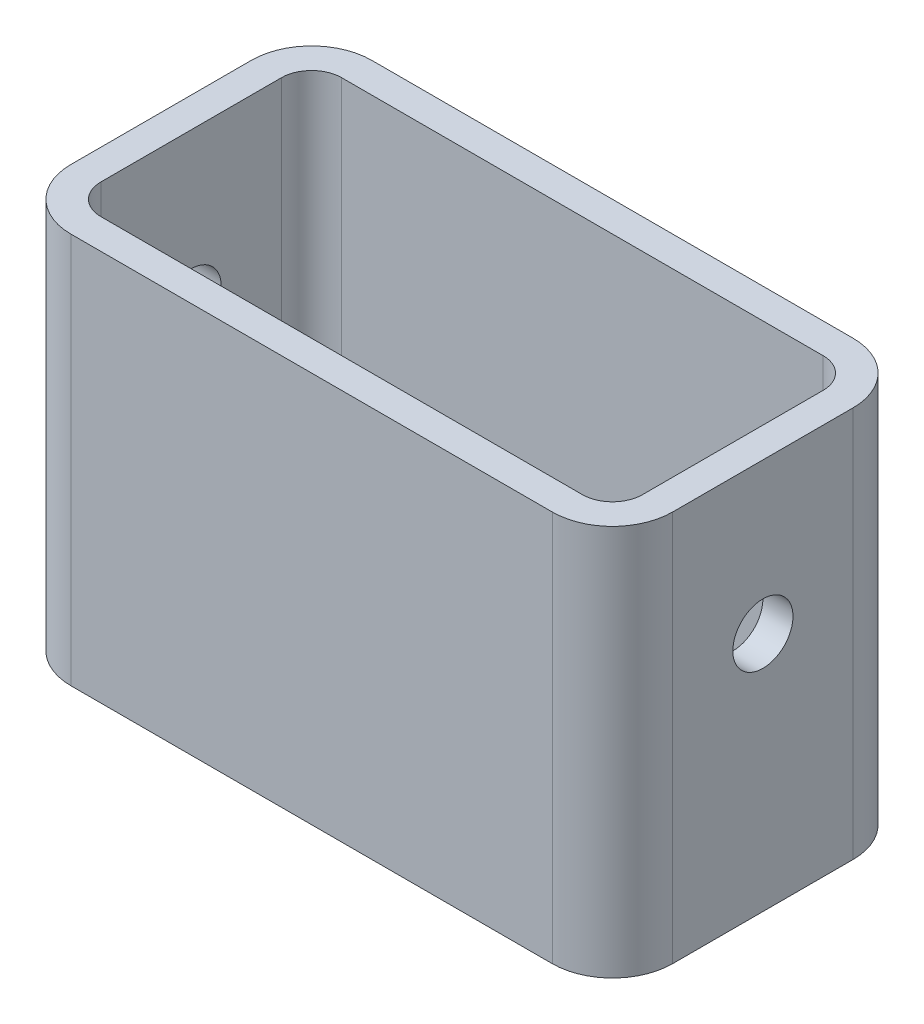
ISO-10303-21;
HEADER;
FILE_DESCRIPTION(('STEP AP214'),'2;1');
FILE_NAME('part.step','',(''),(''),'','','');
FILE_SCHEMA(('AUTOMOTIVE_DESIGN { 1 0 10303 214 1 1 1 1 }'));
ENDSEC;
DATA;
#1=APPLICATION_CONTEXT('core data for automotive mechanical design processes');
#2=APPLICATION_PROTOCOL_DEFINITION('international standard','automotive_design',2000,#1);
#3=PRODUCT_CONTEXT('',#1,'mechanical');
#4=PRODUCT('Part','Part','',(#3));
#5=PRODUCT_RELATED_PRODUCT_CATEGORY('part','',(#4));
#6=PRODUCT_DEFINITION_FORMATION('','',#4);
#7=PRODUCT_DEFINITION_CONTEXT('part definition',#1,'design');
#8=PRODUCT_DEFINITION('design','',#6,#7);
#9=PRODUCT_DEFINITION_SHAPE('','',#8);
#10=(LENGTH_UNIT() NAMED_UNIT(*) SI_UNIT(.MILLI.,.METRE.));
#11=(NAMED_UNIT(*) PLANE_ANGLE_UNIT() SI_UNIT($,.RADIAN.));
#12=(NAMED_UNIT(*) SI_UNIT($,.STERADIAN.) SOLID_ANGLE_UNIT());
#13=UNCERTAINTY_MEASURE_WITH_UNIT(LENGTH_MEASURE(1.E-05),#10,'distance_accuracy_value','');
#14=(GEOMETRIC_REPRESENTATION_CONTEXT(3) GLOBAL_UNCERTAINTY_ASSIGNED_CONTEXT((#13)) GLOBAL_UNIT_ASSIGNED_CONTEXT((#10,
#11,#12)) REPRESENTATION_CONTEXT('',''));
#15=CARTESIAN_POINT('',(0.,0.,0.));
#16=DIRECTION('',(0.,0.,1.));
#17=DIRECTION('',(1.,0.,0.));
#18=AXIS2_PLACEMENT_3D('',#15,#16,#17);
#19=CARTESIAN_POINT('',(0.,0.,50.));
#20=DIRECTION('',(1.,0.,0.));
#21=DIRECTION('',(0.,1.,0.));
#22=AXIS2_PLACEMENT_3D('',#19,#20,#21);
#23=PLANE('',#22);
#24=CARTESIAN_POINT('',(0.,40.,25.));
#25=DIRECTION('',(1.,0.,0.));
#26=DIRECTION('',(0.,1.,0.));
#27=AXIS2_PLACEMENT_3D('',#24,#25,#26);
#28=CIRCLE('',#27,5.);
#29=CARTESIAN_POINT('',(0.,45.,25.));
#30=VERTEX_POINT('',#29);
#31=EDGE_CURVE('E365',#30,#30,#28,.T.);
#32=ORIENTED_EDGE('',*,*,#31,.T.);
#33=EDGE_LOOP('',(#32));
#34=FACE_BOUND('',#33,.T.);
#35=DIRECTION('',(0.,0.,-1.));
#36=VECTOR('',#35,1.);
#37=CARTESIAN_POINT('',(0.,65.,50.));
#38=LINE('',#37,#36);
#39=CARTESIAN_POINT('',(0.,65.,40.));
#40=VERTEX_POINT('',#39);
#41=CARTESIAN_POINT('',(0.,65.,10.));
#42=VERTEX_POINT('',#41);
#43=EDGE_CURVE('E214',#40,#42,#38,.T.);
#44=ORIENTED_EDGE('',*,*,#43,.T.);
#45=DIRECTION('',(0.,-1.,0.));
#46=VECTOR('',#45,1.);
#47=CARTESIAN_POINT('',(0.,0.,10.));
#48=LINE('',#47,#46);
#49=CARTESIAN_POINT('',(0.,0.,10.));
#50=VERTEX_POINT('',#49);
#51=EDGE_CURVE('E232',#42,#50,#48,.T.);
#52=ORIENTED_EDGE('',*,*,#51,.T.);
#53=DIRECTION('',(0.,0.,-1.));
#54=VECTOR('',#53,1.);
#55=CARTESIAN_POINT('',(0.,0.,50.));
#56=LINE('',#55,#54);
#57=CARTESIAN_POINT('',(0.,0.,40.));
#58=VERTEX_POINT('',#57);
#59=EDGE_CURVE('E227',#58,#50,#56,.T.);
#60=ORIENTED_EDGE('',*,*,#59,.F.);
#61=DIRECTION('',(0.,-1.,0.));
#62=VECTOR('',#61,1.);
#63=CARTESIAN_POINT('',(0.,0.,40.));
#64=LINE('',#63,#62);
#65=EDGE_CURVE('E230',#58,#40,#64,.F.);
#66=ORIENTED_EDGE('',*,*,#65,.T.);
#67=EDGE_LOOP('',(#44,#52,#60,#66));
#68=FACE_BOUND('',#67,.T.);
#69=ADVANCED_FACE('F34',(#34,#68),#23,.F.);
#70=CARTESIAN_POINT('',(0.,0.,50.));
#71=DIRECTION('',(0.,1.,0.));
#72=DIRECTION('',(0.,0.,1.));
#73=AXIS2_PLACEMENT_3D('',#70,#71,#72);
#74=PLANE('',#73);
#75=ORIENTED_EDGE('',*,*,#59,.T.);
#76=CARTESIAN_POINT('',(10.,0.,10.));
#77=DIRECTION('',(0.,1.,0.));
#78=DIRECTION('',(0.,0.,1.));
#79=AXIS2_PLACEMENT_3D('',#76,#77,#78);
#80=CIRCLE('',#79,10.);
#81=CARTESIAN_POINT('',(10.,0.,0.));
#82=VERTEX_POINT('',#81);
#83=EDGE_CURVE('E241',#50,#82,#80,.F.);
#84=ORIENTED_EDGE('',*,*,#83,.T.);
#85=DIRECTION('',(1.,0.,0.));
#86=VECTOR('',#85,1.);
#87=CARTESIAN_POINT('',(0.,0.,0.));
#88=LINE('',#87,#86);
#89=CARTESIAN_POINT('',(90.,0.,0.));
#90=VERTEX_POINT('',#89);
#91=EDGE_CURVE('E190',#82,#90,#88,.T.);
#92=ORIENTED_EDGE('',*,*,#91,.T.);
#93=CARTESIAN_POINT('',(90.,0.,10.));
#94=DIRECTION('',(0.,1.,0.));
#95=DIRECTION('',(0.,0.,1.));
#96=AXIS2_PLACEMENT_3D('',#93,#94,#95);
#97=CIRCLE('',#96,10.);
#98=CARTESIAN_POINT('',(100.,0.,10.));
#99=VERTEX_POINT('',#98);
#100=EDGE_CURVE('E239',#90,#99,#97,.F.);
#101=ORIENTED_EDGE('',*,*,#100,.T.);
#102=DIRECTION('',(0.,0.,-1.));
#103=VECTOR('',#102,1.);
#104=CARTESIAN_POINT('',(100.,0.,50.));
#105=LINE('',#104,#103);
#106=CARTESIAN_POINT('',(100.,0.,40.));
#107=VERTEX_POINT('',#106);
#108=EDGE_CURVE('E224',#107,#99,#105,.T.);
#109=ORIENTED_EDGE('',*,*,#108,.F.);
#110=CARTESIAN_POINT('',(90.,0.,40.));
#111=DIRECTION('',(0.,1.,0.));
#112=DIRECTION('',(0.,0.,1.));
#113=AXIS2_PLACEMENT_3D('',#110,#111,#112);
#114=CIRCLE('',#113,10.);
#115=CARTESIAN_POINT('',(90.,0.,50.));
#116=VERTEX_POINT('',#115);
#117=EDGE_CURVE('E235',#107,#116,#114,.F.);
#118=ORIENTED_EDGE('',*,*,#117,.T.);
#119=DIRECTION('',(1.,0.,0.));
#120=VECTOR('',#119,1.);
#121=CARTESIAN_POINT('',(0.,0.,50.));
#122=LINE('',#121,#120);
#123=CARTESIAN_POINT('',(10.,0.,50.));
#124=VERTEX_POINT('',#123);
#125=EDGE_CURVE('E207',#124,#116,#122,.T.);
#126=ORIENTED_EDGE('',*,*,#125,.F.);
#127=CARTESIAN_POINT('',(10.,0.,40.));
#128=DIRECTION('',(0.,1.,0.));
#129=DIRECTION('',(0.,0.,1.));
#130=AXIS2_PLACEMENT_3D('',#127,#128,#129);
#131=CIRCLE('',#130,10.);
#132=EDGE_CURVE('E237',#124,#58,#131,.F.);
#133=ORIENTED_EDGE('',*,*,#132,.T.);
#134=EDGE_LOOP('',(#75,#84,#92,#101,#109,#118,#126,#133));
#135=FACE_BOUND('',#134,.T.);
#136=ADVANCED_FACE('F276',(#135),#74,.F.);
#137=CARTESIAN_POINT('',(100.,0.,50.));
#138=DIRECTION('',(-1.,0.,0.));
#139=DIRECTION('',(0.,-1.,0.));
#140=AXIS2_PLACEMENT_3D('',#137,#138,#139);
#141=PLANE('',#140);
#142=CARTESIAN_POINT('',(100.,40.,25.));
#143=DIRECTION('',(1.,0.,0.));
#144=DIRECTION('',(0.,1.,0.));
#145=AXIS2_PLACEMENT_3D('',#142,#143,#144);
#146=CIRCLE('',#145,5.);
#147=CARTESIAN_POINT('',(100.,45.,25.));
#148=VERTEX_POINT('',#147);
#149=EDGE_CURVE('E363',#148,#148,#146,.T.);
#150=ORIENTED_EDGE('',*,*,#149,.F.);
#151=EDGE_LOOP('',(#150));
#152=FACE_BOUND('',#151,.T.);
#153=ORIENTED_EDGE('',*,*,#108,.T.);
#154=DIRECTION('',(0.,1.,0.));
#155=VECTOR('',#154,1.);
#156=CARTESIAN_POINT('',(100.,65.,10.));
#157=LINE('',#156,#155);
#158=CARTESIAN_POINT('',(100.,65.,10.));
#159=VERTEX_POINT('',#158);
#160=EDGE_CURVE('E256',#99,#159,#157,.T.);
#161=ORIENTED_EDGE('',*,*,#160,.T.);
#162=DIRECTION('',(0.,0.,-1.));
#163=VECTOR('',#162,1.);
#164=CARTESIAN_POINT('',(100.,65.,50.));
#165=LINE('',#164,#163);
#166=CARTESIAN_POINT('',(100.,65.,40.));
#167=VERTEX_POINT('',#166);
#168=EDGE_CURVE('E221',#167,#159,#165,.T.);
#169=ORIENTED_EDGE('',*,*,#168,.F.);
#170=DIRECTION('',(0.,1.,0.));
#171=VECTOR('',#170,1.);
#172=CARTESIAN_POINT('',(100.,0.,40.));
#173=LINE('',#172,#171);
#174=EDGE_CURVE('E254',#167,#107,#173,.F.);
#175=ORIENTED_EDGE('',*,*,#174,.T.);
#176=EDGE_LOOP('',(#153,#161,#169,#175));
#177=FACE_BOUND('',#176,.T.);
#178=ADVANCED_FACE('F281',(#152,#177),#141,.F.);
#179=CARTESIAN_POINT('',(0.,65.,50.));
#180=DIRECTION('',(0.,-1.,0.));
#181=DIRECTION('',(0.,0.,-1.));
#182=AXIS2_PLACEMENT_3D('',#179,#180,#181);
#183=PLANE('',#182);
#184=DIRECTION('',(-1.,0.,0.));
#185=VECTOR('',#184,1.);
#186=CARTESIAN_POINT('',(0.,65.,5.));
#187=LINE('',#186,#185);
#188=CARTESIAN_POINT('',(90.,65.,5.));
#189=VERTEX_POINT('',#188);
#190=CARTESIAN_POINT('',(9.99999999999997,65.,5.));
#191=VERTEX_POINT('',#190);
#192=EDGE_CURVE('E171',#189,#191,#187,.T.);
#193=ORIENTED_EDGE('',*,*,#192,.F.);
#194=CARTESIAN_POINT('',(90.,65.,10.));
#195=DIRECTION('',(0.,-1.,0.));
#196=DIRECTION('',(0.,0.,-1.));
#197=AXIS2_PLACEMENT_3D('',#194,#195,#196);
#198=CIRCLE('',#197,5.);
#199=CARTESIAN_POINT('',(95.,65.,10.));
#200=VERTEX_POINT('',#199);
#201=EDGE_CURVE('E196',#200,#189,#198,.F.);
#202=ORIENTED_EDGE('',*,*,#201,.F.);
#203=DIRECTION('',(0.,0.,-1.));
#204=VECTOR('',#203,1.);
#205=CARTESIAN_POINT('',(95.,65.,50.));
#206=LINE('',#205,#204);
#207=CARTESIAN_POINT('',(95.,65.,40.));
#208=VERTEX_POINT('',#207);
#209=EDGE_CURVE('E50',#208,#200,#206,.T.);
#210=ORIENTED_EDGE('',*,*,#209,.F.);
#211=CARTESIAN_POINT('',(90.,65.,40.));
#212=DIRECTION('',(0.,-1.,0.));
#213=DIRECTION('',(0.,0.,-1.));
#214=AXIS2_PLACEMENT_3D('',#211,#212,#213);
#215=CIRCLE('',#214,5.);
#216=CARTESIAN_POINT('',(90.,65.,45.));
#217=VERTEX_POINT('',#216);
#218=EDGE_CURVE('E177',#217,#208,#215,.F.);
#219=ORIENTED_EDGE('',*,*,#218,.F.);
#220=DIRECTION('',(-1.,0.,0.));
#221=VECTOR('',#220,1.);
#222=CARTESIAN_POINT('',(0.,65.,45.));
#223=LINE('',#222,#221);
#224=CARTESIAN_POINT('',(9.99999999999997,65.,45.));
#225=VERTEX_POINT('',#224);
#226=EDGE_CURVE('E194',#217,#225,#223,.T.);
#227=ORIENTED_EDGE('',*,*,#226,.T.);
#228=CARTESIAN_POINT('',(9.99999999999997,65.,40.));
#229=DIRECTION('',(0.,-1.,0.));
#230=DIRECTION('',(0.,0.,-1.));
#231=AXIS2_PLACEMENT_3D('',#228,#229,#230);
#232=CIRCLE('',#231,5.);
#233=CARTESIAN_POINT('',(4.99999999999997,65.,40.));
#234=VERTEX_POINT('',#233);
#235=EDGE_CURVE('E179',#234,#225,#232,.F.);
#236=ORIENTED_EDGE('',*,*,#235,.F.);
#237=DIRECTION('',(0.,0.,-1.));
#238=VECTOR('',#237,1.);
#239=CARTESIAN_POINT('',(4.99999999999997,65.,50.));
#240=LINE('',#239,#238);
#241=CARTESIAN_POINT('',(4.99999999999997,65.,10.));
#242=VERTEX_POINT('',#241);
#243=EDGE_CURVE('E191',#234,#242,#240,.T.);
#244=ORIENTED_EDGE('',*,*,#243,.T.);
#245=CARTESIAN_POINT('',(9.99999999999997,65.,10.));
#246=DIRECTION('',(0.,-1.,0.));
#247=DIRECTION('',(0.,0.,-1.));
#248=AXIS2_PLACEMENT_3D('',#245,#246,#247);
#249=CIRCLE('',#248,5.);
#250=EDGE_CURVE('E203',#191,#242,#249,.F.);
#251=ORIENTED_EDGE('',*,*,#250,.F.);
#252=EDGE_LOOP('',(#193,#202,#210,#219,#227,#236,#244,#251));
#253=FACE_BOUND('',#252,.T.);
#254=DIRECTION('',(-1.,0.,0.));
#255=VECTOR('',#254,1.);
#256=CARTESIAN_POINT('',(0.,65.,0.));
#257=LINE('',#256,#255);
#258=CARTESIAN_POINT('',(90.,65.,0.));
#259=VERTEX_POINT('',#258);
#260=CARTESIAN_POINT('',(9.99999999999997,65.,0.));
#261=VERTEX_POINT('',#260);
#262=EDGE_CURVE('E211',#259,#261,#257,.T.);
#263=ORIENTED_EDGE('',*,*,#262,.T.);
#264=CARTESIAN_POINT('',(9.99999999999997,65.,10.));
#265=DIRECTION('',(0.,-1.,0.));
#266=DIRECTION('',(0.,0.,-1.));
#267=AXIS2_PLACEMENT_3D('',#264,#265,#266);
#268=CIRCLE('',#267,10.);
#269=EDGE_CURVE('E252',#261,#42,#268,.F.);
#270=ORIENTED_EDGE('',*,*,#269,.T.);
#271=ORIENTED_EDGE('',*,*,#43,.F.);
#272=CARTESIAN_POINT('',(9.99999999999997,65.,40.));
#273=DIRECTION('',(0.,-1.,0.));
#274=DIRECTION('',(0.,0.,-1.));
#275=AXIS2_PLACEMENT_3D('',#272,#273,#274);
#276=CIRCLE('',#275,10.);
#277=CARTESIAN_POINT('',(9.99999999999997,65.,50.));
#278=VERTEX_POINT('',#277);
#279=EDGE_CURVE('E249',#40,#278,#276,.F.);
#280=ORIENTED_EDGE('',*,*,#279,.T.);
#281=DIRECTION('',(-1.,0.,0.));
#282=VECTOR('',#281,1.);
#283=CARTESIAN_POINT('',(0.,65.,50.));
#284=LINE('',#283,#282);
#285=CARTESIAN_POINT('',(90.,65.,50.));
#286=VERTEX_POINT('',#285);
#287=EDGE_CURVE('E210',#286,#278,#284,.T.);
#288=ORIENTED_EDGE('',*,*,#287,.F.);
#289=CARTESIAN_POINT('',(90.,65.,40.));
#290=DIRECTION('',(0.,-1.,0.));
#291=DIRECTION('',(0.,0.,-1.));
#292=AXIS2_PLACEMENT_3D('',#289,#290,#291);
#293=CIRCLE('',#292,10.);
#294=EDGE_CURVE('E247',#286,#167,#293,.F.);
#295=ORIENTED_EDGE('',*,*,#294,.T.);
#296=ORIENTED_EDGE('',*,*,#168,.T.);
#297=CARTESIAN_POINT('',(90.,65.,10.));
#298=DIRECTION('',(0.,-1.,0.));
#299=DIRECTION('',(0.,0.,-1.));
#300=AXIS2_PLACEMENT_3D('',#297,#298,#299);
#301=CIRCLE('',#300,10.);
#302=EDGE_CURVE('E58',#159,#259,#301,.F.);
#303=ORIENTED_EDGE('',*,*,#302,.T.);
#304=EDGE_LOOP('',(#263,#270,#271,#280,#288,#295,#296,#303));
#305=FACE_BOUND('',#304,.T.);
#306=ADVANCED_FACE('F268',(#253,#305),#183,.F.);
#307=CARTESIAN_POINT('',(0.,0.,50.));
#308=DIRECTION('',(0.,0.,-1.));
#309=DIRECTION('',(-1.,0.,0.));
#310=AXIS2_PLACEMENT_3D('',#307,#308,#309);
#311=PLANE('',#310);
#312=ORIENTED_EDGE('',*,*,#287,.T.);
#313=DIRECTION('',(0.,-1.,0.));
#314=VECTOR('',#313,1.);
#315=CARTESIAN_POINT('',(10.,0.,50.));
#316=LINE('',#315,#314);
#317=EDGE_CURVE('E11',#278,#124,#316,.T.);
#318=ORIENTED_EDGE('',*,*,#317,.T.);
#319=ORIENTED_EDGE('',*,*,#125,.T.);
#320=DIRECTION('',(0.,1.,0.));
#321=VECTOR('',#320,1.);
#322=CARTESIAN_POINT('',(90.,0.,50.));
#323=LINE('',#322,#321);
#324=EDGE_CURVE('E43',#116,#286,#323,.T.);
#325=ORIENTED_EDGE('',*,*,#324,.T.);
#326=EDGE_LOOP('',(#312,#318,#319,#325));
#327=FACE_BOUND('',#326,.T.);
#328=ADVANCED_FACE('F262',(#327),#311,.F.);
#329=CARTESIAN_POINT('',(0.,0.,0.));
#330=DIRECTION('',(0.,0.,-1.));
#331=DIRECTION('',(-1.,0.,0.));
#332=AXIS2_PLACEMENT_3D('',#329,#330,#331);
#333=PLANE('',#332);
#334=ORIENTED_EDGE('',*,*,#91,.F.);
#335=DIRECTION('',(0.,-1.,0.));
#336=VECTOR('',#335,1.);
#337=CARTESIAN_POINT('',(9.99999999999997,65.,0.));
#338=LINE('',#337,#336);
#339=EDGE_CURVE('E245',#82,#261,#338,.F.);
#340=ORIENTED_EDGE('',*,*,#339,.T.);
#341=ORIENTED_EDGE('',*,*,#262,.F.);
#342=DIRECTION('',(0.,1.,0.));
#343=VECTOR('',#342,1.);
#344=CARTESIAN_POINT('',(90.,0.,0.));
#345=LINE('',#344,#343);
#346=EDGE_CURVE('E243',#259,#90,#345,.F.);
#347=ORIENTED_EDGE('',*,*,#346,.T.);
#348=EDGE_LOOP('',(#334,#340,#341,#347));
#349=FACE_BOUND('',#348,.T.);
#350=ADVANCED_FACE('F286',(#349),#333,.T.);
#351=CARTESIAN_POINT('',(10.,0.,10.));
#352=DIRECTION('',(0.,1.,0.));
#353=DIRECTION('',(-1.,0.,0.));
#354=AXIS2_PLACEMENT_3D('',#351,#352,#353);
#355=CYLINDRICAL_SURFACE('',#354,10.);
#356=ORIENTED_EDGE('',*,*,#269,.F.);
#357=ORIENTED_EDGE('',*,*,#339,.F.);
#358=ORIENTED_EDGE('',*,*,#83,.F.);
#359=ORIENTED_EDGE('',*,*,#51,.F.);
#360=EDGE_LOOP('',(#356,#357,#358,#359));
#361=FACE_BOUND('',#360,.T.);
#362=ADVANCED_FACE('F291',(#361),#355,.T.);
#363=CARTESIAN_POINT('',(90.,0.,10.));
#364=DIRECTION('',(0.,-1.,0.));
#365=DIRECTION('',(1.,0.,0.));
#366=AXIS2_PLACEMENT_3D('',#363,#364,#365);
#367=CYLINDRICAL_SURFACE('',#366,10.);
#368=ORIENTED_EDGE('',*,*,#100,.F.);
#369=ORIENTED_EDGE('',*,*,#346,.F.);
#370=ORIENTED_EDGE('',*,*,#302,.F.);
#371=ORIENTED_EDGE('',*,*,#160,.F.);
#372=EDGE_LOOP('',(#368,#369,#370,#371));
#373=FACE_BOUND('',#372,.T.);
#374=ADVANCED_FACE('F289',(#373),#367,.T.);
#375=CARTESIAN_POINT('',(10.,0.,40.));
#376=DIRECTION('',(0.,-1.,0.));
#377=DIRECTION('',(1.,0.,0.));
#378=AXIS2_PLACEMENT_3D('',#375,#376,#377);
#379=CYLINDRICAL_SURFACE('',#378,10.);
#380=ORIENTED_EDGE('',*,*,#279,.F.);
#381=ORIENTED_EDGE('',*,*,#65,.F.);
#382=ORIENTED_EDGE('',*,*,#132,.F.);
#383=ORIENTED_EDGE('',*,*,#317,.F.);
#384=EDGE_LOOP('',(#380,#381,#382,#383));
#385=FACE_BOUND('',#384,.T.);
#386=ADVANCED_FACE('F274',(#385),#379,.T.);
#387=CARTESIAN_POINT('',(90.,0.,40.));
#388=DIRECTION('',(0.,1.,0.));
#389=DIRECTION('',(-1.,0.,0.));
#390=AXIS2_PLACEMENT_3D('',#387,#388,#389);
#391=CYLINDRICAL_SURFACE('',#390,10.);
#392=ORIENTED_EDGE('',*,*,#117,.F.);
#393=ORIENTED_EDGE('',*,*,#174,.F.);
#394=ORIENTED_EDGE('',*,*,#294,.F.);
#395=ORIENTED_EDGE('',*,*,#324,.F.);
#396=EDGE_LOOP('',(#392,#393,#394,#395));
#397=FACE_BOUND('',#396,.T.);
#398=ADVANCED_FACE('F36',(#397),#391,.T.);
#399=CARTESIAN_POINT('',(5.,0.,50.));
#400=DIRECTION('',(1.,0.,0.));
#401=DIRECTION('',(0.,1.,0.));
#402=AXIS2_PLACEMENT_3D('',#399,#400,#401);
#403=PLANE('',#402);
#404=CARTESIAN_POINT('',(4.99999999999998,40.,25.));
#405=DIRECTION('',(1.,0.,0.));
#406=DIRECTION('',(0.,1.,0.));
#407=AXIS2_PLACEMENT_3D('',#404,#405,#406);
#408=CIRCLE('',#407,5.);
#409=CARTESIAN_POINT('',(4.99999999999998,45.,25.));
#410=VERTEX_POINT('',#409);
#411=EDGE_CURVE('E172',#410,#410,#408,.T.);
#412=ORIENTED_EDGE('',*,*,#411,.F.);
#413=EDGE_LOOP('',(#412));
#414=FACE_BOUND('',#413,.T.);
#415=ORIENTED_EDGE('',*,*,#243,.F.);
#416=DIRECTION('',(0.,1.,0.));
#417=VECTOR('',#416,1.);
#418=CARTESIAN_POINT('',(5.,0.,40.));
#419=LINE('',#418,#417);
#420=CARTESIAN_POINT('',(5.,5.,40.));
#421=VERTEX_POINT('',#420);
#422=EDGE_CURVE('E373',#421,#234,#419,.T.);
#423=ORIENTED_EDGE('',*,*,#422,.F.);
#424=DIRECTION('',(0.,0.,-1.));
#425=VECTOR('',#424,1.);
#426=CARTESIAN_POINT('',(5.,5.,50.));
#427=LINE('',#426,#425);
#428=CARTESIAN_POINT('',(5.,5.,10.));
#429=VERTEX_POINT('',#428);
#430=EDGE_CURVE('E374',#421,#429,#427,.T.);
#431=ORIENTED_EDGE('',*,*,#430,.T.);
#432=DIRECTION('',(0.,1.,0.));
#433=VECTOR('',#432,1.);
#434=CARTESIAN_POINT('',(5.,0.,10.));
#435=LINE('',#434,#433);
#436=EDGE_CURVE('E157',#242,#429,#435,.F.);
#437=ORIENTED_EDGE('',*,*,#436,.F.);
#438=EDGE_LOOP('',(#415,#423,#431,#437));
#439=FACE_BOUND('',#438,.T.);
#440=ADVANCED_FACE('F313',(#414,#439),#403,.T.);
#441=CARTESIAN_POINT('',(0.,5.,50.));
#442=DIRECTION('',(0.,1.,0.));
#443=DIRECTION('',(0.,0.,1.));
#444=AXIS2_PLACEMENT_3D('',#441,#442,#443);
#445=PLANE('',#444);
#446=ORIENTED_EDGE('',*,*,#430,.F.);
#447=CARTESIAN_POINT('',(10.,5.,40.));
#448=DIRECTION('',(0.,1.,0.));
#449=DIRECTION('',(0.,0.,1.));
#450=AXIS2_PLACEMENT_3D('',#447,#448,#449);
#451=CIRCLE('',#450,5.);
#452=CARTESIAN_POINT('',(9.99999999999997,5.,45.));
#453=VERTEX_POINT('',#452);
#454=EDGE_CURVE('E378',#453,#421,#451,.F.);
#455=ORIENTED_EDGE('',*,*,#454,.F.);
#456=DIRECTION('',(1.,0.,0.));
#457=VECTOR('',#456,1.);
#458=CARTESIAN_POINT('',(0.,5.,45.));
#459=LINE('',#458,#457);
#460=CARTESIAN_POINT('',(90.,5.,45.));
#461=VERTEX_POINT('',#460);
#462=EDGE_CURVE('E198',#453,#461,#459,.T.);
#463=ORIENTED_EDGE('',*,*,#462,.T.);
#464=CARTESIAN_POINT('',(90.,5.,40.));
#465=DIRECTION('',(0.,1.,0.));
#466=DIRECTION('',(0.,0.,1.));
#467=AXIS2_PLACEMENT_3D('',#464,#465,#466);
#468=CIRCLE('',#467,5.);
#469=CARTESIAN_POINT('',(95.,5.,40.));
#470=VERTEX_POINT('',#469);
#471=EDGE_CURVE('E372',#470,#461,#468,.F.);
#472=ORIENTED_EDGE('',*,*,#471,.F.);
#473=DIRECTION('',(0.,0.,-1.));
#474=VECTOR('',#473,1.);
#475=CARTESIAN_POINT('',(95.,5.,50.));
#476=LINE('',#475,#474);
#477=CARTESIAN_POINT('',(95.,5.,10.));
#478=VERTEX_POINT('',#477);
#479=EDGE_CURVE('E201',#470,#478,#476,.T.);
#480=ORIENTED_EDGE('',*,*,#479,.T.);
#481=CARTESIAN_POINT('',(90.,5.,10.));
#482=DIRECTION('',(0.,1.,0.));
#483=DIRECTION('',(0.,0.,1.));
#484=AXIS2_PLACEMENT_3D('',#481,#482,#483);
#485=CIRCLE('',#484,5.);
#486=CARTESIAN_POINT('',(90.,5.,5.));
#487=VERTEX_POINT('',#486);
#488=EDGE_CURVE('E162',#487,#478,#485,.F.);
#489=ORIENTED_EDGE('',*,*,#488,.F.);
#490=DIRECTION('',(1.,0.,0.));
#491=VECTOR('',#490,1.);
#492=CARTESIAN_POINT('',(0.,5.,5.));
#493=LINE('',#492,#491);
#494=CARTESIAN_POINT('',(10.,5.,5.));
#495=VERTEX_POINT('',#494);
#496=EDGE_CURVE('E166',#495,#487,#493,.T.);
#497=ORIENTED_EDGE('',*,*,#496,.F.);
#498=CARTESIAN_POINT('',(10.,5.,10.));
#499=DIRECTION('',(0.,1.,0.));
#500=DIRECTION('',(0.,0.,1.));
#501=AXIS2_PLACEMENT_3D('',#498,#499,#500);
#502=CIRCLE('',#501,5.);
#503=EDGE_CURVE('E150',#429,#495,#502,.F.);
#504=ORIENTED_EDGE('',*,*,#503,.F.);
#505=EDGE_LOOP('',(#446,#455,#463,#472,#480,#489,#497,#504));
#506=FACE_BOUND('',#505,.T.);
#507=ADVANCED_FACE('F167',(#506),#445,.T.);
#508=CARTESIAN_POINT('',(95.,0.,50.));
#509=DIRECTION('',(-1.,0.,0.));
#510=DIRECTION('',(0.,-1.,0.));
#511=AXIS2_PLACEMENT_3D('',#508,#509,#510);
#512=PLANE('',#511);
#513=CARTESIAN_POINT('',(95.,40.,25.));
#514=DIRECTION('',(-1.,0.,0.));
#515=DIRECTION('',(0.,-1.,0.));
#516=AXIS2_PLACEMENT_3D('',#513,#514,#515);
#517=CIRCLE('',#516,5.);
#518=CARTESIAN_POINT('',(95.,35.,25.));
#519=VERTEX_POINT('',#518);
#520=EDGE_CURVE('E38',#519,#519,#517,.T.);
#521=ORIENTED_EDGE('',*,*,#520,.F.);
#522=EDGE_LOOP('',(#521));
#523=FACE_BOUND('',#522,.T.);
#524=ORIENTED_EDGE('',*,*,#479,.F.);
#525=DIRECTION('',(0.,-1.,0.));
#526=VECTOR('',#525,1.);
#527=CARTESIAN_POINT('',(95.,0.,40.));
#528=LINE('',#527,#526);
#529=EDGE_CURVE('E206',#208,#470,#528,.T.);
#530=ORIENTED_EDGE('',*,*,#529,.F.);
#531=ORIENTED_EDGE('',*,*,#209,.T.);
#532=DIRECTION('',(0.,-1.,0.));
#533=VECTOR('',#532,1.);
#534=CARTESIAN_POINT('',(95.,0.,10.));
#535=LINE('',#534,#533);
#536=EDGE_CURVE('E187',#478,#200,#535,.F.);
#537=ORIENTED_EDGE('',*,*,#536,.F.);
#538=EDGE_LOOP('',(#524,#530,#531,#537));
#539=FACE_BOUND('',#538,.T.);
#540=ADVANCED_FACE('F324',(#523,#539),#512,.T.);
#541=CARTESIAN_POINT('',(0.,0.,45.));
#542=DIRECTION('',(0.,0.,-1.));
#543=DIRECTION('',(-1.,0.,0.));
#544=AXIS2_PLACEMENT_3D('',#541,#542,#543);
#545=PLANE('',#544);
#546=ORIENTED_EDGE('',*,*,#226,.F.);
#547=DIRECTION('',(0.,1.,0.));
#548=VECTOR('',#547,1.);
#549=CARTESIAN_POINT('',(90.,0.,45.));
#550=LINE('',#549,#548);
#551=EDGE_CURVE('E184',#461,#217,#550,.T.);
#552=ORIENTED_EDGE('',*,*,#551,.F.);
#553=ORIENTED_EDGE('',*,*,#462,.F.);
#554=DIRECTION('',(0.,1.,0.));
#555=VECTOR('',#554,1.);
#556=CARTESIAN_POINT('',(9.99999999999997,0.,45.));
#557=LINE('',#556,#555);
#558=EDGE_CURVE('E186',#225,#453,#557,.F.);
#559=ORIENTED_EDGE('',*,*,#558,.F.);
#560=EDGE_LOOP('',(#546,#552,#553,#559));
#561=FACE_BOUND('',#560,.T.);
#562=ADVANCED_FACE('F332',(#561),#545,.T.);
#563=CARTESIAN_POINT('',(0.,0.,5.));
#564=DIRECTION('',(0.,0.,-1.));
#565=DIRECTION('',(-1.,0.,0.));
#566=AXIS2_PLACEMENT_3D('',#563,#564,#565);
#567=PLANE('',#566);
#568=ORIENTED_EDGE('',*,*,#496,.T.);
#569=DIRECTION('',(0.,1.,0.));
#570=VECTOR('',#569,1.);
#571=CARTESIAN_POINT('',(90.,0.,5.));
#572=LINE('',#571,#570);
#573=EDGE_CURVE('E161',#189,#487,#572,.F.);
#574=ORIENTED_EDGE('',*,*,#573,.F.);
#575=ORIENTED_EDGE('',*,*,#192,.T.);
#576=DIRECTION('',(0.,1.,0.));
#577=VECTOR('',#576,1.);
#578=CARTESIAN_POINT('',(10.,0.,5.));
#579=LINE('',#578,#577);
#580=EDGE_CURVE('E154',#495,#191,#579,.T.);
#581=ORIENTED_EDGE('',*,*,#580,.F.);
#582=EDGE_LOOP('',(#568,#574,#575,#581));
#583=FACE_BOUND('',#582,.T.);
#584=ADVANCED_FACE('F174',(#583),#567,.F.);
#585=CARTESIAN_POINT('',(10.,0.,10.));
#586=DIRECTION('',(0.,1.,0.));
#587=DIRECTION('',(-1.,0.,0.));
#588=AXIS2_PLACEMENT_3D('',#585,#586,#587);
#589=CYLINDRICAL_SURFACE('',#588,5.);
#590=ORIENTED_EDGE('',*,*,#250,.T.);
#591=ORIENTED_EDGE('',*,*,#436,.T.);
#592=ORIENTED_EDGE('',*,*,#503,.T.);
#593=ORIENTED_EDGE('',*,*,#580,.T.);
#594=EDGE_LOOP('',(#590,#591,#592,#593));
#595=FACE_BOUND('',#594,.T.);
#596=ADVANCED_FACE('F152',(#595),#589,.F.);
#597=CARTESIAN_POINT('',(90.,0.,10.));
#598=DIRECTION('',(0.,-1.,0.));
#599=DIRECTION('',(1.,0.,0.));
#600=AXIS2_PLACEMENT_3D('',#597,#598,#599);
#601=CYLINDRICAL_SURFACE('',#600,5.);
#602=ORIENTED_EDGE('',*,*,#488,.T.);
#603=ORIENTED_EDGE('',*,*,#536,.T.);
#604=ORIENTED_EDGE('',*,*,#201,.T.);
#605=ORIENTED_EDGE('',*,*,#573,.T.);
#606=EDGE_LOOP('',(#602,#603,#604,#605));
#607=FACE_BOUND('',#606,.T.);
#608=ADVANCED_FACE('F340',(#607),#601,.F.);
#609=CARTESIAN_POINT('',(10.,0.,40.));
#610=DIRECTION('',(0.,-1.,0.));
#611=DIRECTION('',(1.,0.,0.));
#612=AXIS2_PLACEMENT_3D('',#609,#610,#611);
#613=CYLINDRICAL_SURFACE('',#612,5.);
#614=ORIENTED_EDGE('',*,*,#235,.T.);
#615=ORIENTED_EDGE('',*,*,#558,.T.);
#616=ORIENTED_EDGE('',*,*,#454,.T.);
#617=ORIENTED_EDGE('',*,*,#422,.T.);
#618=EDGE_LOOP('',(#614,#615,#616,#617));
#619=FACE_BOUND('',#618,.T.);
#620=ADVANCED_FACE('F343',(#619),#613,.F.);
#621=CARTESIAN_POINT('',(90.,0.,40.));
#622=DIRECTION('',(0.,1.,0.));
#623=DIRECTION('',(-1.,0.,0.));
#624=AXIS2_PLACEMENT_3D('',#621,#622,#623);
#625=CYLINDRICAL_SURFACE('',#624,5.);
#626=ORIENTED_EDGE('',*,*,#471,.T.);
#627=ORIENTED_EDGE('',*,*,#551,.T.);
#628=ORIENTED_EDGE('',*,*,#218,.T.);
#629=ORIENTED_EDGE('',*,*,#529,.T.);
#630=EDGE_LOOP('',(#626,#627,#628,#629));
#631=FACE_BOUND('',#630,.T.);
#632=ADVANCED_FACE('F347',(#631),#625,.F.);
#633=CARTESIAN_POINT('',(0.,40.,25.));
#634=DIRECTION('',(1.,0.,0.));
#635=DIRECTION('',(0.,1.,0.));
#636=AXIS2_PLACEMENT_3D('',#633,#634,#635);
#637=CYLINDRICAL_SURFACE('',#636,5.);
#638=ORIENTED_EDGE('',*,*,#520,.T.);
#639=EDGE_LOOP('',(#638));
#640=FACE_BOUND('',#639,.T.);
#641=ORIENTED_EDGE('',*,*,#149,.T.);
#642=EDGE_LOOP('',(#641));
#643=FACE_BOUND('',#642,.T.);
#644=ADVANCED_FACE('F329',(#640,#643),#637,.F.);
#645=ORIENTED_EDGE('',*,*,#411,.T.);
#646=EDGE_LOOP('',(#645));
#647=FACE_BOUND('',#646,.T.);
#648=ORIENTED_EDGE('',*,*,#31,.F.);
#649=EDGE_LOOP('',(#648));
#650=FACE_BOUND('',#649,.T.);
#651=ADVANCED_FACE('F400',(#647,#650),#637,.F.);
#652=CLOSED_SHELL('',(#69,#136,#178,#306,#328,#350,#362,#374,#386,#398,#440,#507,#540,#562,#584,
#596,#608,#620,#632,#644,#651));
#653=MANIFOLD_SOLID_BREP('B2',#652);
#654=ADVANCED_BREP_SHAPE_REPRESENTATION('',(#18,#653),#14);
#655=SHAPE_DEFINITION_REPRESENTATION(#9,#654);
ENDSEC;
END-ISO-10303-21;
